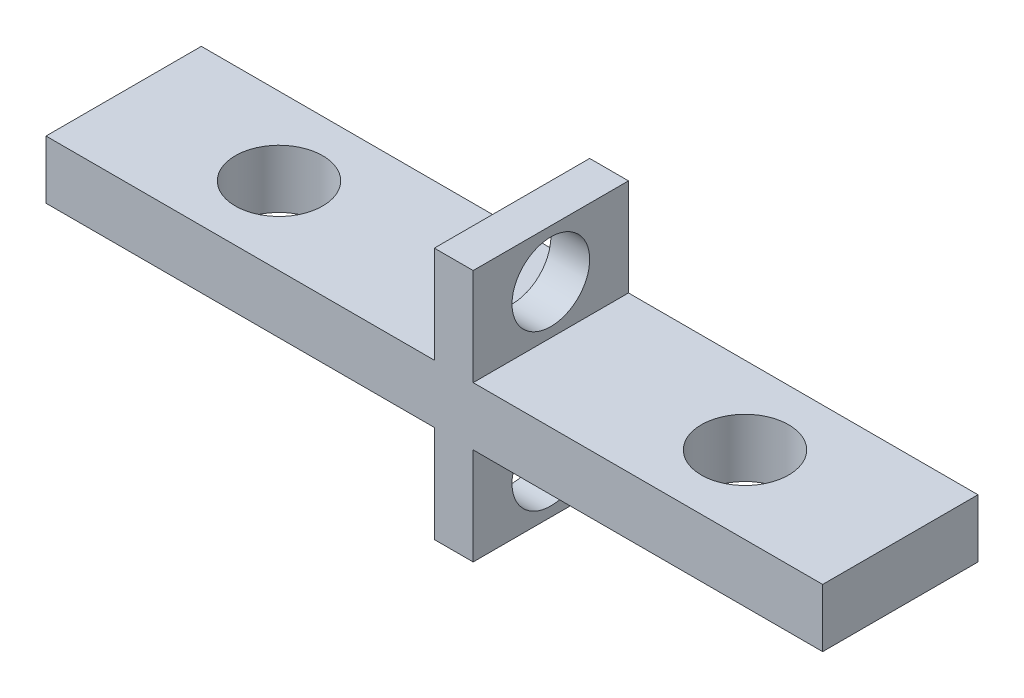
ISO-10303-21;
HEADER;
FILE_DESCRIPTION(('STEP AP214'),'2;1');
FILE_NAME('part.step','',(''),(''),'','','');
FILE_SCHEMA(('AUTOMOTIVE_DESIGN { 1 0 10303 214 1 1 1 1 }'));
ENDSEC;
DATA;
#1=APPLICATION_CONTEXT('core data for automotive mechanical design processes');
#2=APPLICATION_PROTOCOL_DEFINITION('international standard','automotive_design',2000,#1);
#3=PRODUCT_CONTEXT('',#1,'mechanical');
#4=PRODUCT('Part','Part','',(#3));
#5=PRODUCT_RELATED_PRODUCT_CATEGORY('part','',(#4));
#6=PRODUCT_DEFINITION_FORMATION('','',#4);
#7=PRODUCT_DEFINITION_CONTEXT('part definition',#1,'design');
#8=PRODUCT_DEFINITION('design','',#6,#7);
#9=PRODUCT_DEFINITION_SHAPE('','',#8);
#10=(LENGTH_UNIT() NAMED_UNIT(*) SI_UNIT(.MILLI.,.METRE.));
#11=(NAMED_UNIT(*) PLANE_ANGLE_UNIT() SI_UNIT($,.RADIAN.));
#12=(NAMED_UNIT(*) SI_UNIT($,.STERADIAN.) SOLID_ANGLE_UNIT());
#13=UNCERTAINTY_MEASURE_WITH_UNIT(LENGTH_MEASURE(1.E-05),#10,'distance_accuracy_value','');
#14=(GEOMETRIC_REPRESENTATION_CONTEXT(3) GLOBAL_UNCERTAINTY_ASSIGNED_CONTEXT((#13)) GLOBAL_UNIT_ASSIGNED_CONTEXT((#10,
#11,#12)) REPRESENTATION_CONTEXT('',''));
#15=CARTESIAN_POINT('',(0.,0.,0.));
#16=DIRECTION('',(0.,0.,1.));
#17=DIRECTION('',(1.,0.,0.));
#18=AXIS2_PLACEMENT_3D('',#15,#16,#17);
#19=CARTESIAN_POINT('',(0.,3.,0.));
#20=DIRECTION('',(0.,1.,0.));
#21=DIRECTION('',(0.,0.,1.));
#22=AXIS2_PLACEMENT_3D('',#19,#20,#21);
#23=PLANE('',#22);
#24=DIRECTION('',(0.,0.,1.));
#25=VECTOR('',#24,1.);
#26=CARTESIAN_POINT('',(12.7736329978232,3.,0.));
#27=LINE('',#26,#25);
#28=CARTESIAN_POINT('',(12.7736329978232,3.,-4.3135593220339));
#29=VERTEX_POINT('',#28);
#30=CARTESIAN_POINT('',(12.7736329978232,3.,3.6864406779661));
#31=VERTEX_POINT('',#30);
#32=EDGE_CURVE('E48',#29,#31,#27,.T.);
#33=ORIENTED_EDGE('',*,*,#32,.F.);
#34=DIRECTION('',(-1.,0.,0.));
#35=VECTOR('',#34,1.);
#36=CARTESIAN_POINT('',(-7.22636700217678,3.,-4.3135593220339));
#37=LINE('',#36,#35);
#38=CARTESIAN_POINT('',(-7.22636700217678,3.,-4.3135593220339));
#39=VERTEX_POINT('',#38);
#40=EDGE_CURVE('E203',#29,#39,#37,.T.);
#41=ORIENTED_EDGE('',*,*,#40,.T.);
#42=DIRECTION('',(0.,0.,1.));
#43=VECTOR('',#42,1.);
#44=CARTESIAN_POINT('',(-7.22636700217678,3.,-4.3135593220339));
#45=LINE('',#44,#43);
#46=CARTESIAN_POINT('',(-7.22636700217678,3.,3.6864406779661));
#47=VERTEX_POINT('',#46);
#48=EDGE_CURVE('E194',#39,#47,#45,.T.);
#49=ORIENTED_EDGE('',*,*,#48,.T.);
#50=DIRECTION('',(1.,0.,0.));
#51=VECTOR('',#50,1.);
#52=CARTESIAN_POINT('',(-7.22636700217678,3.,3.6864406779661));
#53=LINE('',#52,#51);
#54=EDGE_CURVE('E199',#47,#31,#53,.T.);
#55=ORIENTED_EDGE('',*,*,#54,.T.);
#56=EDGE_LOOP('',(#33,#41,#49,#55));
#57=FACE_BOUND('',#56,.T.);
#58=CARTESIAN_POINT('',(0.773632997823222,3.,-0.313559322033901));
#59=DIRECTION('',(0.,1.,0.));
#60=DIRECTION('',(0.,0.,1.));
#61=AXIS2_PLACEMENT_3D('',#58,#59,#60);
#62=CIRCLE('',#61,2.2479);
#63=CARTESIAN_POINT('',(0.773632997823222,3.,1.9343406779661));
#64=VERTEX_POINT('',#63);
#65=EDGE_CURVE('E181',#64,#64,#62,.T.);
#66=ORIENTED_EDGE('',*,*,#65,.F.);
#67=EDGE_LOOP('',(#66));
#68=FACE_BOUND('',#67,.T.);
#69=ADVANCED_FACE('F33',(#57,#68),#23,.T.);
#70=CARTESIAN_POINT('',(0.,0.,0.));
#71=DIRECTION('',(0.,1.,0.));
#72=DIRECTION('',(0.,0.,1.));
#73=AXIS2_PLACEMENT_3D('',#70,#71,#72);
#74=PLANE('',#73);
#75=CARTESIAN_POINT('',(0.773632997823222,0.,-0.313559322033901));
#76=DIRECTION('',(0.,1.,0.));
#77=DIRECTION('',(0.,0.,1.));
#78=AXIS2_PLACEMENT_3D('',#75,#76,#77);
#79=CIRCLE('',#78,2.2479);
#80=CARTESIAN_POINT('',(0.773632997823222,0.,1.9343406779661));
#81=VERTEX_POINT('',#80);
#82=EDGE_CURVE('E184',#81,#81,#79,.T.);
#83=ORIENTED_EDGE('',*,*,#82,.T.);
#84=EDGE_LOOP('',(#83));
#85=FACE_BOUND('',#84,.T.);
#86=DIRECTION('',(-1.,0.,0.));
#87=VECTOR('',#86,1.);
#88=CARTESIAN_POINT('',(-7.22636700217678,0.,-4.3135593220339));
#89=LINE('',#88,#87);
#90=CARTESIAN_POINT('',(12.7736329978232,0.,-4.3135593220339));
#91=VERTEX_POINT('',#90);
#92=CARTESIAN_POINT('',(-7.22636700217678,0.,-4.3135593220339));
#93=VERTEX_POINT('',#92);
#94=EDGE_CURVE('E214',#91,#93,#89,.T.);
#95=ORIENTED_EDGE('',*,*,#94,.F.);
#96=DIRECTION('',(0.,0.,1.));
#97=VECTOR('',#96,1.);
#98=CARTESIAN_POINT('',(12.7736329978232,0.,0.));
#99=LINE('',#98,#97);
#100=CARTESIAN_POINT('',(12.7736329978232,0.,3.6864406779661));
#101=VERTEX_POINT('',#100);
#102=EDGE_CURVE('E11',#91,#101,#99,.T.);
#103=ORIENTED_EDGE('',*,*,#102,.T.);
#104=DIRECTION('',(1.,0.,0.));
#105=VECTOR('',#104,1.);
#106=CARTESIAN_POINT('',(-7.22636700217678,0.,3.6864406779661));
#107=LINE('',#106,#105);
#108=CARTESIAN_POINT('',(-7.22636700217678,0.,3.6864406779661));
#109=VERTEX_POINT('',#108);
#110=EDGE_CURVE('E209',#109,#101,#107,.T.);
#111=ORIENTED_EDGE('',*,*,#110,.F.);
#112=DIRECTION('',(0.,0.,1.));
#113=VECTOR('',#112,1.);
#114=CARTESIAN_POINT('',(-7.22636700217678,0.,-4.3135593220339));
#115=LINE('',#114,#113);
#116=EDGE_CURVE('E193',#93,#109,#115,.T.);
#117=ORIENTED_EDGE('',*,*,#116,.F.);
#118=EDGE_LOOP('',(#95,#103,#111,#117));
#119=FACE_BOUND('',#118,.T.);
#120=ADVANCED_FACE('F255',(#85,#119),#74,.F.);
#121=CARTESIAN_POINT('',(-7.22636700217678,3.,-4.3135593220339));
#122=DIRECTION('',(1.,0.,0.));
#123=DIRECTION('',(0.,0.,-1.));
#124=AXIS2_PLACEMENT_3D('',#121,#122,#123);
#125=PLANE('',#124);
#126=ORIENTED_EDGE('',*,*,#116,.T.);
#127=DIRECTION('',(0.,-1.,0.));
#128=VECTOR('',#127,1.);
#129=CARTESIAN_POINT('',(-7.22636700217678,3.,3.6864406779661));
#130=LINE('',#129,#128);
#131=EDGE_CURVE('E225',#47,#109,#130,.T.);
#132=ORIENTED_EDGE('',*,*,#131,.F.);
#133=ORIENTED_EDGE('',*,*,#48,.F.);
#134=DIRECTION('',(0.,-1.,0.));
#135=VECTOR('',#134,1.);
#136=CARTESIAN_POINT('',(-7.22636700217678,3.,-4.3135593220339));
#137=LINE('',#136,#135);
#138=EDGE_CURVE('E205',#39,#93,#137,.T.);
#139=ORIENTED_EDGE('',*,*,#138,.T.);
#140=EDGE_LOOP('',(#126,#132,#133,#139));
#141=FACE_BOUND('',#140,.T.);
#142=ADVANCED_FACE('F35',(#141),#125,.F.);
#143=CARTESIAN_POINT('',(-7.22636700217678,3.,3.6864406779661));
#144=DIRECTION('',(0.,0.,-1.));
#145=DIRECTION('',(-1.,0.,0.));
#146=AXIS2_PLACEMENT_3D('',#143,#144,#145);
#147=PLANE('',#146);
#148=CARTESIAN_POINT('',(14.7736329978232,3.,3.6864406779661));
#149=VERTEX_POINT('',#148);
#150=CARTESIAN_POINT('',(32.7736329978232,3.,3.6864406779661));
#151=VERTEX_POINT('',#150);
#152=EDGE_CURVE('E197',#149,#151,#53,.T.);
#153=ORIENTED_EDGE('',*,*,#152,.F.);
#154=DIRECTION('',(0.,1.,0.));
#155=VECTOR('',#154,1.);
#156=CARTESIAN_POINT('',(14.7736329978232,-5.,3.6864406779661));
#157=LINE('',#156,#155);
#158=CARTESIAN_POINT('',(14.7736329978232,7.99999999999997,3.6864406779661));
#159=VERTEX_POINT('',#158);
#160=EDGE_CURVE('E137',#149,#159,#157,.T.);
#161=ORIENTED_EDGE('',*,*,#160,.T.);
#162=DIRECTION('',(1.,0.,0.));
#163=VECTOR('',#162,1.);
#164=CARTESIAN_POINT('',(12.7736329978232,7.99999999999997,3.6864406779661));
#165=LINE('',#164,#163);
#166=CARTESIAN_POINT('',(12.7736329978232,7.99999999999997,3.6864406779661));
#167=VERTEX_POINT('',#166);
#168=EDGE_CURVE('E134',#167,#159,#165,.T.);
#169=ORIENTED_EDGE('',*,*,#168,.F.);
#170=DIRECTION('',(0.,1.,0.));
#171=VECTOR('',#170,1.);
#172=CARTESIAN_POINT('',(12.7736329978232,-5.,3.6864406779661));
#173=LINE('',#172,#171);
#174=EDGE_CURVE('E123',#31,#167,#173,.T.);
#175=ORIENTED_EDGE('',*,*,#174,.F.);
#176=ORIENTED_EDGE('',*,*,#54,.F.);
#177=ORIENTED_EDGE('',*,*,#131,.T.);
#178=ORIENTED_EDGE('',*,*,#110,.T.);
#179=CARTESIAN_POINT('',(12.7736329978232,-5.,3.6864406779661));
#180=VERTEX_POINT('',#179);
#181=EDGE_CURVE('E130',#180,#101,#173,.T.);
#182=ORIENTED_EDGE('',*,*,#181,.F.);
#183=DIRECTION('',(1.,0.,0.));
#184=VECTOR('',#183,1.);
#185=CARTESIAN_POINT('',(12.7736329978232,-5.,3.6864406779661));
#186=LINE('',#185,#184);
#187=CARTESIAN_POINT('',(14.7736329978232,-5.,3.6864406779661));
#188=VERTEX_POINT('',#187);
#189=EDGE_CURVE('E161',#180,#188,#186,.T.);
#190=ORIENTED_EDGE('',*,*,#189,.T.);
#191=CARTESIAN_POINT('',(14.7736329978232,0.,3.6864406779661));
#192=VERTEX_POINT('',#191);
#193=EDGE_CURVE('E177',#188,#192,#157,.T.);
#194=ORIENTED_EDGE('',*,*,#193,.T.);
#195=CARTESIAN_POINT('',(32.7736329978232,0.,3.6864406779661));
#196=VERTEX_POINT('',#195);
#197=EDGE_CURVE('E208',#192,#196,#107,.T.);
#198=ORIENTED_EDGE('',*,*,#197,.T.);
#199=DIRECTION('',(0.,-1.,0.));
#200=VECTOR('',#199,1.);
#201=CARTESIAN_POINT('',(32.7736329978232,3.,3.6864406779661));
#202=LINE('',#201,#200);
#203=EDGE_CURVE('E222',#151,#196,#202,.T.);
#204=ORIENTED_EDGE('',*,*,#203,.F.);
#205=EDGE_LOOP('',(#153,#161,#169,#175,#176,#177,#178,#182,#190,#194,#198,#204));
#206=FACE_BOUND('',#205,.T.);
#207=ADVANCED_FACE('F135',(#206),#147,.F.);
#208=CARTESIAN_POINT('',(32.7736329978232,3.,-4.3135593220339));
#209=DIRECTION('',(-1.,0.,0.));
#210=DIRECTION('',(0.,0.,1.));
#211=AXIS2_PLACEMENT_3D('',#208,#209,#210);
#212=PLANE('',#211);
#213=DIRECTION('',(0.,0.,-1.));
#214=VECTOR('',#213,1.);
#215=CARTESIAN_POINT('',(32.7736329978232,0.,-4.3135593220339));
#216=LINE('',#215,#214);
#217=CARTESIAN_POINT('',(32.7736329978232,0.,-4.3135593220339));
#218=VERTEX_POINT('',#217);
#219=EDGE_CURVE('E212',#196,#218,#216,.T.);
#220=ORIENTED_EDGE('',*,*,#219,.T.);
#221=DIRECTION('',(0.,-1.,0.));
#222=VECTOR('',#221,1.);
#223=CARTESIAN_POINT('',(32.7736329978232,3.,-4.3135593220339));
#224=LINE('',#223,#222);
#225=CARTESIAN_POINT('',(32.7736329978232,3.,-4.3135593220339));
#226=VERTEX_POINT('',#225);
#227=EDGE_CURVE('E219',#226,#218,#224,.T.);
#228=ORIENTED_EDGE('',*,*,#227,.F.);
#229=DIRECTION('',(0.,0.,-1.));
#230=VECTOR('',#229,1.);
#231=CARTESIAN_POINT('',(32.7736329978232,3.,-4.3135593220339));
#232=LINE('',#231,#230);
#233=EDGE_CURVE('E201',#151,#226,#232,.T.);
#234=ORIENTED_EDGE('',*,*,#233,.F.);
#235=ORIENTED_EDGE('',*,*,#203,.T.);
#236=EDGE_LOOP('',(#220,#228,#234,#235));
#237=FACE_BOUND('',#236,.T.);
#238=ADVANCED_FACE('F241',(#237),#212,.F.);
#239=CARTESIAN_POINT('',(-7.22636700217678,3.,-4.3135593220339));
#240=DIRECTION('',(0.,0.,1.));
#241=DIRECTION('',(1.,0.,0.));
#242=AXIS2_PLACEMENT_3D('',#239,#240,#241);
#243=PLANE('',#242);
#244=CARTESIAN_POINT('',(14.7736329978232,0.,-4.3135593220339));
#245=VERTEX_POINT('',#244);
#246=EDGE_CURVE('E198',#218,#245,#89,.T.);
#247=ORIENTED_EDGE('',*,*,#246,.T.);
#248=DIRECTION('',(0.,1.,0.));
#249=VECTOR('',#248,1.);
#250=CARTESIAN_POINT('',(14.7736329978232,-5.,-4.3135593220339));
#251=LINE('',#250,#249);
#252=CARTESIAN_POINT('',(14.7736329978232,-5.,-4.3135593220339));
#253=VERTEX_POINT('',#252);
#254=EDGE_CURVE('E174',#253,#245,#251,.T.);
#255=ORIENTED_EDGE('',*,*,#254,.F.);
#256=DIRECTION('',(-1.,0.,0.));
#257=VECTOR('',#256,1.);
#258=CARTESIAN_POINT('',(12.7736329978232,-5.,-4.3135593220339));
#259=LINE('',#258,#257);
#260=CARTESIAN_POINT('',(12.7736329978232,-5.,-4.3135593220339));
#261=VERTEX_POINT('',#260);
#262=EDGE_CURVE('E131',#253,#261,#259,.T.);
#263=ORIENTED_EDGE('',*,*,#262,.T.);
#264=DIRECTION('',(0.,1.,0.));
#265=VECTOR('',#264,1.);
#266=CARTESIAN_POINT('',(12.7736329978232,-5.,-4.3135593220339));
#267=LINE('',#266,#265);
#268=EDGE_CURVE('E169',#261,#91,#267,.T.);
#269=ORIENTED_EDGE('',*,*,#268,.T.);
#270=ORIENTED_EDGE('',*,*,#94,.T.);
#271=ORIENTED_EDGE('',*,*,#138,.F.);
#272=ORIENTED_EDGE('',*,*,#40,.F.);
#273=CARTESIAN_POINT('',(12.7736329978232,7.99999999999997,-4.3135593220339));
#274=VERTEX_POINT('',#273);
#275=EDGE_CURVE('E173',#29,#274,#267,.T.);
#276=ORIENTED_EDGE('',*,*,#275,.T.);
#277=DIRECTION('',(-1.,0.,0.));
#278=VECTOR('',#277,1.);
#279=CARTESIAN_POINT('',(12.7736329978232,7.99999999999997,-4.3135593220339));
#280=LINE('',#279,#278);
#281=CARTESIAN_POINT('',(14.7736329978232,7.99999999999997,-4.3135593220339));
#282=VERTEX_POINT('',#281);
#283=EDGE_CURVE('E146',#282,#274,#280,.T.);
#284=ORIENTED_EDGE('',*,*,#283,.F.);
#285=CARTESIAN_POINT('',(14.7736329978232,3.,-4.3135593220339));
#286=VERTEX_POINT('',#285);
#287=EDGE_CURVE('E176',#286,#282,#251,.T.);
#288=ORIENTED_EDGE('',*,*,#287,.F.);
#289=EDGE_CURVE('E56',#226,#286,#37,.T.);
#290=ORIENTED_EDGE('',*,*,#289,.F.);
#291=ORIENTED_EDGE('',*,*,#227,.T.);
#292=EDGE_LOOP('',(#247,#255,#263,#269,#270,#271,#272,#276,#284,#288,#290,#291));
#293=FACE_BOUND('',#292,.T.);
#294=ADVANCED_FACE('F236',(#293),#243,.F.);
#295=DIRECTION('',(0.,0.,-1.));
#296=VECTOR('',#295,1.);
#297=CARTESIAN_POINT('',(14.7736329978232,3.,0.));
#298=LINE('',#297,#296);
#299=EDGE_CURVE('E172',#149,#286,#298,.T.);
#300=ORIENTED_EDGE('',*,*,#299,.F.);
#301=ORIENTED_EDGE('',*,*,#152,.T.);
#302=ORIENTED_EDGE('',*,*,#233,.T.);
#303=ORIENTED_EDGE('',*,*,#289,.T.);
#304=EDGE_LOOP('',(#300,#301,#302,#303));
#305=FACE_BOUND('',#304,.T.);
#306=CARTESIAN_POINT('',(24.7736329978232,3.,-0.313559322033901));
#307=DIRECTION('',(0.,1.,0.));
#308=DIRECTION('',(0.,0.,1.));
#309=AXIS2_PLACEMENT_3D('',#306,#307,#308);
#310=CIRCLE('',#309,2.2479);
#311=CARTESIAN_POINT('',(24.7736329978232,3.,1.9343406779661));
#312=VERTEX_POINT('',#311);
#313=EDGE_CURVE('E187',#312,#312,#310,.T.);
#314=ORIENTED_EDGE('',*,*,#313,.F.);
#315=EDGE_LOOP('',(#314));
#316=FACE_BOUND('',#315,.T.);
#317=ADVANCED_FACE('F276',(#305,#316),#23,.T.);
#318=CARTESIAN_POINT('',(24.7736329978232,0.,-0.313559322033901));
#319=DIRECTION('',(0.,1.,0.));
#320=DIRECTION('',(0.,0.,1.));
#321=AXIS2_PLACEMENT_3D('',#318,#319,#320);
#322=CIRCLE('',#321,2.2479);
#323=CARTESIAN_POINT('',(24.7736329978232,0.,1.9343406779661));
#324=VERTEX_POINT('',#323);
#325=EDGE_CURVE('E190',#324,#324,#322,.T.);
#326=ORIENTED_EDGE('',*,*,#325,.T.);
#327=EDGE_LOOP('',(#326));
#328=FACE_BOUND('',#327,.T.);
#329=ORIENTED_EDGE('',*,*,#197,.F.);
#330=DIRECTION('',(0.,0.,-1.));
#331=VECTOR('',#330,1.);
#332=CARTESIAN_POINT('',(14.7736329978232,0.,0.));
#333=LINE('',#332,#331);
#334=EDGE_CURVE('E41',#192,#245,#333,.T.);
#335=ORIENTED_EDGE('',*,*,#334,.T.);
#336=ORIENTED_EDGE('',*,*,#246,.F.);
#337=ORIENTED_EDGE('',*,*,#219,.F.);
#338=EDGE_LOOP('',(#329,#335,#336,#337));
#339=FACE_BOUND('',#338,.T.);
#340=ADVANCED_FACE('F232',(#328,#339),#74,.F.);
#341=CARTESIAN_POINT('',(24.7736329978232,3.,-0.313559322033901));
#342=DIRECTION('',(0.,1.,0.));
#343=DIRECTION('',(0.,0.,1.));
#344=AXIS2_PLACEMENT_3D('',#341,#342,#343);
#345=CYLINDRICAL_SURFACE('',#344,2.2479);
#346=ORIENTED_EDGE('',*,*,#313,.T.);
#347=EDGE_LOOP('',(#346));
#348=FACE_BOUND('',#347,.T.);
#349=ORIENTED_EDGE('',*,*,#325,.F.);
#350=EDGE_LOOP('',(#349));
#351=FACE_BOUND('',#350,.T.);
#352=ADVANCED_FACE('F288',(#348,#351),#345,.F.);
#353=CARTESIAN_POINT('',(0.773632997823222,3.,-0.313559322033901));
#354=DIRECTION('',(0.,1.,0.));
#355=DIRECTION('',(0.,0.,1.));
#356=AXIS2_PLACEMENT_3D('',#353,#354,#355);
#357=CYLINDRICAL_SURFACE('',#356,2.2479);
#358=ORIENTED_EDGE('',*,*,#65,.T.);
#359=EDGE_LOOP('',(#358));
#360=FACE_BOUND('',#359,.T.);
#361=ORIENTED_EDGE('',*,*,#82,.F.);
#362=EDGE_LOOP('',(#361));
#363=FACE_BOUND('',#362,.T.);
#364=ADVANCED_FACE('F296',(#360,#363),#357,.F.);
#365=CARTESIAN_POINT('',(0.,-5.,0.));
#366=DIRECTION('',(0.,-1.,0.));
#367=DIRECTION('',(0.,0.,-1.));
#368=AXIS2_PLACEMENT_3D('',#365,#366,#367);
#369=PLANE('',#368);
#370=DIRECTION('',(0.,0.,1.));
#371=VECTOR('',#370,1.);
#372=CARTESIAN_POINT('',(12.7736329978232,-5.,3.6864406779661));
#373=LINE('',#372,#371);
#374=EDGE_CURVE('E158',#261,#180,#373,.T.);
#375=ORIENTED_EDGE('',*,*,#374,.F.);
#376=ORIENTED_EDGE('',*,*,#262,.F.);
#377=DIRECTION('',(0.,0.,-1.));
#378=VECTOR('',#377,1.);
#379=CARTESIAN_POINT('',(14.7736329978232,-5.,3.6864406779661));
#380=LINE('',#379,#378);
#381=EDGE_CURVE('E164',#188,#253,#380,.T.);
#382=ORIENTED_EDGE('',*,*,#381,.F.);
#383=ORIENTED_EDGE('',*,*,#189,.F.);
#384=EDGE_LOOP('',(#375,#376,#382,#383));
#385=FACE_BOUND('',#384,.T.);
#386=ADVANCED_FACE('F249',(#385),#369,.T.);
#387=CARTESIAN_POINT('',(14.7736329978232,-5.,3.6864406779661));
#388=DIRECTION('',(1.,0.,0.));
#389=DIRECTION('',(0.,0.,-1.));
#390=AXIS2_PLACEMENT_3D('',#387,#388,#389);
#391=PLANE('',#390);
#392=CARTESIAN_POINT('',(14.7736329978232,-2.5,-0.313559322033899));
#393=DIRECTION('',(-1.,0.,0.));
#394=DIRECTION('',(0.,0.,1.));
#395=AXIS2_PLACEMENT_3D('',#392,#393,#394);
#396=CIRCLE('',#395,2.);
#397=CARTESIAN_POINT('',(14.7736329978232,-2.5,1.6864406779661));
#398=VERTEX_POINT('',#397);
#399=EDGE_CURVE('E328',#398,#398,#396,.T.);
#400=ORIENTED_EDGE('',*,*,#399,.T.);
#401=EDGE_LOOP('',(#400));
#402=FACE_BOUND('',#401,.T.);
#403=ORIENTED_EDGE('',*,*,#334,.F.);
#404=ORIENTED_EDGE('',*,*,#193,.F.);
#405=ORIENTED_EDGE('',*,*,#381,.T.);
#406=ORIENTED_EDGE('',*,*,#254,.T.);
#407=EDGE_LOOP('',(#403,#404,#405,#406));
#408=FACE_BOUND('',#407,.T.);
#409=ADVANCED_FACE('F245',(#402,#408),#391,.T.);
#410=CARTESIAN_POINT('',(12.7736329978232,-5.,3.6864406779661));
#411=DIRECTION('',(-1.,0.,0.));
#412=DIRECTION('',(0.,0.,1.));
#413=AXIS2_PLACEMENT_3D('',#410,#411,#412);
#414=PLANE('',#413);
#415=CARTESIAN_POINT('',(12.7736329978232,-2.5,-0.313559322033899));
#416=DIRECTION('',(-1.,0.,0.));
#417=DIRECTION('',(0.,0.,1.));
#418=AXIS2_PLACEMENT_3D('',#415,#416,#417);
#419=CIRCLE('',#418,2.);
#420=CARTESIAN_POINT('',(12.7736329978232,-2.5,1.6864406779661));
#421=VERTEX_POINT('',#420);
#422=EDGE_CURVE('E153',#421,#421,#419,.T.);
#423=ORIENTED_EDGE('',*,*,#422,.F.);
#424=EDGE_LOOP('',(#423));
#425=FACE_BOUND('',#424,.T.);
#426=ORIENTED_EDGE('',*,*,#102,.F.);
#427=ORIENTED_EDGE('',*,*,#268,.F.);
#428=ORIENTED_EDGE('',*,*,#374,.T.);
#429=ORIENTED_EDGE('',*,*,#181,.T.);
#430=EDGE_LOOP('',(#426,#427,#428,#429));
#431=FACE_BOUND('',#430,.T.);
#432=ADVANCED_FACE('F260',(#425,#431),#414,.T.);
#433=CARTESIAN_POINT('',(12.7736329978232,5.49999999999997,-0.3135593220339));
#434=DIRECTION('',(-1.,0.,0.));
#435=DIRECTION('',(0.,0.,1.));
#436=AXIS2_PLACEMENT_3D('',#433,#434,#435);
#437=CIRCLE('',#436,2.);
#438=CARTESIAN_POINT('',(12.7736329978232,5.49999999999997,1.6864406779661));
#439=VERTEX_POINT('',#438);
#440=EDGE_CURVE('E150',#439,#439,#437,.T.);
#441=ORIENTED_EDGE('',*,*,#440,.F.);
#442=EDGE_LOOP('',(#441));
#443=FACE_BOUND('',#442,.T.);
#444=ORIENTED_EDGE('',*,*,#275,.F.);
#445=ORIENTED_EDGE('',*,*,#32,.T.);
#446=ORIENTED_EDGE('',*,*,#174,.T.);
#447=DIRECTION('',(0.,0.,1.));
#448=VECTOR('',#447,1.);
#449=CARTESIAN_POINT('',(12.7736329978232,7.99999999999997,3.6864406779661));
#450=LINE('',#449,#448);
#451=EDGE_CURVE('E128',#274,#167,#450,.T.);
#452=ORIENTED_EDGE('',*,*,#451,.F.);
#453=EDGE_LOOP('',(#444,#445,#446,#452));
#454=FACE_BOUND('',#453,.T.);
#455=ADVANCED_FACE('F126',(#443,#454),#414,.T.);
#456=CARTESIAN_POINT('',(14.7736329978232,5.49999999999997,-0.3135593220339));
#457=DIRECTION('',(-1.,0.,0.));
#458=DIRECTION('',(0.,0.,1.));
#459=AXIS2_PLACEMENT_3D('',#456,#457,#458);
#460=CIRCLE('',#459,2.);
#461=CARTESIAN_POINT('',(14.7736329978232,5.49999999999997,1.6864406779661));
#462=VERTEX_POINT('',#461);
#463=EDGE_CURVE('E147',#462,#462,#460,.T.);
#464=ORIENTED_EDGE('',*,*,#463,.T.);
#465=EDGE_LOOP('',(#464));
#466=FACE_BOUND('',#465,.T.);
#467=ORIENTED_EDGE('',*,*,#160,.F.);
#468=ORIENTED_EDGE('',*,*,#299,.T.);
#469=ORIENTED_EDGE('',*,*,#287,.T.);
#470=DIRECTION('',(0.,0.,-1.));
#471=VECTOR('',#470,1.);
#472=CARTESIAN_POINT('',(14.7736329978232,7.99999999999997,3.6864406779661));
#473=LINE('',#472,#471);
#474=EDGE_CURVE('E141',#159,#282,#473,.T.);
#475=ORIENTED_EDGE('',*,*,#474,.F.);
#476=EDGE_LOOP('',(#467,#468,#469,#475));
#477=FACE_BOUND('',#476,.T.);
#478=ADVANCED_FACE('F268',(#466,#477),#391,.T.);
#479=CARTESIAN_POINT('',(0.,7.99999999999997,0.));
#480=DIRECTION('',(0.,-1.,0.));
#481=DIRECTION('',(0.,0.,-1.));
#482=AXIS2_PLACEMENT_3D('',#479,#480,#481);
#483=PLANE('',#482);
#484=ORIENTED_EDGE('',*,*,#451,.T.);
#485=ORIENTED_EDGE('',*,*,#168,.T.);
#486=ORIENTED_EDGE('',*,*,#474,.T.);
#487=ORIENTED_EDGE('',*,*,#283,.T.);
#488=EDGE_LOOP('',(#484,#485,#486,#487));
#489=FACE_BOUND('',#488,.T.);
#490=ADVANCED_FACE('F144',(#489),#483,.F.);
#491=CARTESIAN_POINT('',(14.7736329978232,5.49999999999997,-0.3135593220339));
#492=DIRECTION('',(-1.,0.,0.));
#493=DIRECTION('',(0.,0.,1.));
#494=AXIS2_PLACEMENT_3D('',#491,#492,#493);
#495=CYLINDRICAL_SURFACE('',#494,2.);
#496=ORIENTED_EDGE('',*,*,#463,.F.);
#497=EDGE_LOOP('',(#496));
#498=FACE_BOUND('',#497,.T.);
#499=ORIENTED_EDGE('',*,*,#440,.T.);
#500=EDGE_LOOP('',(#499));
#501=FACE_BOUND('',#500,.T.);
#502=ADVANCED_FACE('F318',(#498,#501),#495,.F.);
#503=CARTESIAN_POINT('',(14.7736329978232,-2.5,-0.313559322033899));
#504=DIRECTION('',(-1.,0.,0.));
#505=DIRECTION('',(0.,0.,1.));
#506=AXIS2_PLACEMENT_3D('',#503,#504,#505);
#507=CYLINDRICAL_SURFACE('',#506,2.);
#508=ORIENTED_EDGE('',*,*,#399,.F.);
#509=EDGE_LOOP('',(#508));
#510=FACE_BOUND('',#509,.T.);
#511=ORIENTED_EDGE('',*,*,#422,.T.);
#512=EDGE_LOOP('',(#511));
#513=FACE_BOUND('',#512,.T.);
#514=ADVANCED_FACE('F324',(#510,#513),#507,.F.);
#515=CLOSED_SHELL('',(#69,#120,#142,#207,#238,#294,#317,#340,#352,#364,#386,#409,#432,#455,#478,
#490,#502,#514));
#516=MANIFOLD_SOLID_BREP('B2',#515);
#517=ADVANCED_BREP_SHAPE_REPRESENTATION('',(#18,#516),#14);
#518=SHAPE_DEFINITION_REPRESENTATION(#9,#517);
ENDSEC;
END-ISO-10303-21;
